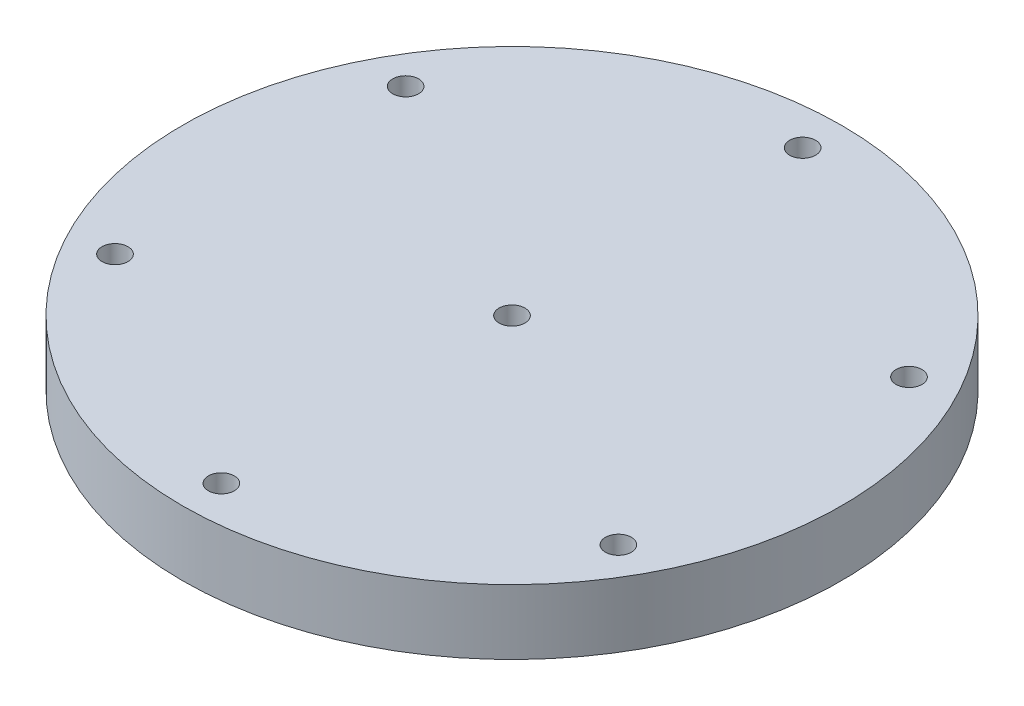
ISO-10303-21;
HEADER;
FILE_DESCRIPTION(('STEP AP214'),'2;1');
FILE_NAME('part.step','',(''),(''),'','','');
FILE_SCHEMA(('AUTOMOTIVE_DESIGN { 1 0 10303 214 1 1 1 1 }'));
ENDSEC;
DATA;
#1=APPLICATION_CONTEXT('core data for automotive mechanical design processes');
#2=APPLICATION_PROTOCOL_DEFINITION('international standard','automotive_design',2000,#1);
#3=PRODUCT_CONTEXT('',#1,'mechanical');
#4=PRODUCT('Part','Part','',(#3));
#5=PRODUCT_RELATED_PRODUCT_CATEGORY('part','',(#4));
#6=PRODUCT_DEFINITION_FORMATION('','',#4);
#7=PRODUCT_DEFINITION_CONTEXT('part definition',#1,'design');
#8=PRODUCT_DEFINITION('design','',#6,#7);
#9=PRODUCT_DEFINITION_SHAPE('','',#8);
#10=(LENGTH_UNIT() NAMED_UNIT(*) SI_UNIT(.MILLI.,.METRE.));
#11=(NAMED_UNIT(*) PLANE_ANGLE_UNIT() SI_UNIT($,.RADIAN.));
#12=(NAMED_UNIT(*) SI_UNIT($,.STERADIAN.) SOLID_ANGLE_UNIT());
#13=UNCERTAINTY_MEASURE_WITH_UNIT(LENGTH_MEASURE(1.E-05),#10,'distance_accuracy_value','');
#14=(GEOMETRIC_REPRESENTATION_CONTEXT(3) GLOBAL_UNCERTAINTY_ASSIGNED_CONTEXT((#13)) GLOBAL_UNIT_ASSIGNED_CONTEXT((#10,
#11,#12)) REPRESENTATION_CONTEXT('',''));
#15=CARTESIAN_POINT('',(0.,0.,0.));
#16=DIRECTION('',(0.,0.,1.));
#17=DIRECTION('',(1.,0.,0.));
#18=AXIS2_PLACEMENT_3D('',#15,#16,#17);
#19=CARTESIAN_POINT('',(0.,10.,0.));
#20=DIRECTION('',(0.,-1.,0.));
#21=DIRECTION('',(0.,0.,-1.));
#22=AXIS2_PLACEMENT_3D('',#19,#20,#21);
#23=CYLINDRICAL_SURFACE('',#22,50.8);
#24=CARTESIAN_POINT('',(0.,10.,0.));
#25=DIRECTION('',(0.,1.,0.));
#26=DIRECTION('',(0.,0.,1.));
#27=AXIS2_PLACEMENT_3D('',#24,#25,#26);
#28=CIRCLE('',#27,50.8);
#29=CARTESIAN_POINT('',(0.,10.,50.8));
#30=VERTEX_POINT('',#29);
#31=EDGE_CURVE('E10',#30,#30,#28,.T.);
#32=ORIENTED_EDGE('',*,*,#31,.F.);
#33=EDGE_LOOP('',(#32));
#34=FACE_BOUND('',#33,.T.);
#35=CARTESIAN_POINT('',(0.,0.,0.));
#36=DIRECTION('',(0.,1.,0.));
#37=DIRECTION('',(0.,0.,1.));
#38=AXIS2_PLACEMENT_3D('',#35,#36,#37);
#39=CIRCLE('',#38,50.8);
#40=CARTESIAN_POINT('',(0.,0.,50.8));
#41=VERTEX_POINT('',#40);
#42=EDGE_CURVE('E51',#41,#41,#39,.T.);
#43=ORIENTED_EDGE('',*,*,#42,.T.);
#44=EDGE_LOOP('',(#43));
#45=FACE_BOUND('',#44,.T.);
#46=ADVANCED_FACE('F43',(#34,#45),#23,.T.);
#47=CARTESIAN_POINT('',(0.,10.,0.));
#48=DIRECTION('',(0.,1.,0.));
#49=DIRECTION('',(0.,0.,1.));
#50=AXIS2_PLACEMENT_3D('',#47,#48,#49);
#51=PLANE('',#50);
#52=CARTESIAN_POINT('',(-38.7979380895426,10.,-22.4000000000004));
#53=DIRECTION('',(0.,1.,0.));
#54=DIRECTION('',(0.,0.,1.));
#55=AXIS2_PLACEMENT_3D('',#52,#53,#54);
#56=CIRCLE('',#55,2.);
#57=CARTESIAN_POINT('',(-38.7979380895426,10.,-20.4000000000004));
#58=VERTEX_POINT('',#57);
#59=EDGE_CURVE('E200',#58,#58,#56,.T.);
#60=ORIENTED_EDGE('',*,*,#59,.F.);
#61=EDGE_LOOP('',(#60));
#62=FACE_BOUND('',#61,.T.);
#63=CARTESIAN_POINT('',(-38.7979380895431,10.,22.3999999999996));
#64=DIRECTION('',(0.,1.,0.));
#65=DIRECTION('',(0.,0.,1.));
#66=AXIS2_PLACEMENT_3D('',#63,#64,#65);
#67=CIRCLE('',#66,2.);
#68=CARTESIAN_POINT('',(-38.7979380895431,10.,24.3999999999996));
#69=VERTEX_POINT('',#68);
#70=EDGE_CURVE('E196',#69,#69,#67,.T.);
#71=ORIENTED_EDGE('',*,*,#70,.F.);
#72=EDGE_LOOP('',(#71));
#73=FACE_BOUND('',#72,.T.);
#74=CARTESIAN_POINT('',(-3.12836727960345E-13,10.,44.8));
#75=DIRECTION('',(0.,1.,0.));
#76=DIRECTION('',(0.,0.,1.));
#77=AXIS2_PLACEMENT_3D('',#74,#75,#76);
#78=CIRCLE('',#77,2.);
#79=CARTESIAN_POINT('',(-3.12836727960345E-13,10.,46.8));
#80=VERTEX_POINT('',#79);
#81=EDGE_CURVE('E192',#80,#80,#78,.T.);
#82=ORIENTED_EDGE('',*,*,#81,.F.);
#83=EDGE_LOOP('',(#82));
#84=FACE_BOUND('',#83,.T.);
#85=CARTESIAN_POINT('',(38.7979380895428,10.,22.4000000000002));
#86=DIRECTION('',(0.,1.,0.));
#87=DIRECTION('',(0.,0.,1.));
#88=AXIS2_PLACEMENT_3D('',#85,#86,#87);
#89=CIRCLE('',#88,2.);
#90=CARTESIAN_POINT('',(38.7979380895428,10.,24.4000000000002));
#91=VERTEX_POINT('',#90);
#92=EDGE_CURVE('E186',#91,#91,#89,.T.);
#93=ORIENTED_EDGE('',*,*,#92,.F.);
#94=EDGE_LOOP('',(#93));
#95=FACE_BOUND('',#94,.T.);
#96=CARTESIAN_POINT('',(38.7979380895429,10.,-22.3999999999999));
#97=DIRECTION('',(0.,1.,0.));
#98=DIRECTION('',(0.,0.,1.));
#99=AXIS2_PLACEMENT_3D('',#96,#97,#98);
#100=CIRCLE('',#99,2.);
#101=CARTESIAN_POINT('',(38.7979380895429,10.,-20.3999999999999));
#102=VERTEX_POINT('',#101);
#103=EDGE_CURVE('E180',#102,#102,#100,.T.);
#104=ORIENTED_EDGE('',*,*,#103,.F.);
#105=EDGE_LOOP('',(#104));
#106=FACE_BOUND('',#105,.T.);
#107=CARTESIAN_POINT('',(0.,10.,-44.8));
#108=DIRECTION('',(0.,1.,0.));
#109=DIRECTION('',(0.,0.,1.));
#110=AXIS2_PLACEMENT_3D('',#107,#108,#109);
#111=CIRCLE('',#110,2.);
#112=CARTESIAN_POINT('',(0.,10.,-42.8));
#113=VERTEX_POINT('',#112);
#114=EDGE_CURVE('E175',#113,#113,#111,.T.);
#115=ORIENTED_EDGE('',*,*,#114,.F.);
#116=EDGE_LOOP('',(#115));
#117=FACE_BOUND('',#116,.T.);
#118=CARTESIAN_POINT('',(0.,10.,0.));
#119=DIRECTION('',(0.,1.,0.));
#120=DIRECTION('',(0.,0.,1.));
#121=AXIS2_PLACEMENT_3D('',#118,#119,#120);
#122=CIRCLE('',#121,2.);
#123=CARTESIAN_POINT('',(0.,10.,2.));
#124=VERTEX_POINT('',#123);
#125=EDGE_CURVE('E68',#124,#124,#122,.T.);
#126=ORIENTED_EDGE('',*,*,#125,.F.);
#127=EDGE_LOOP('',(#126));
#128=FACE_BOUND('',#127,.T.);
#129=ORIENTED_EDGE('',*,*,#31,.T.);
#130=EDGE_LOOP('',(#129));
#131=FACE_BOUND('',#130,.T.);
#132=ADVANCED_FACE('F116',(#62,#73,#84,#95,#106,#117,#128,#131),#51,.T.);
#133=CARTESIAN_POINT('',(0.,0.,0.));
#134=DIRECTION('',(0.,1.,0.));
#135=DIRECTION('',(0.,0.,1.));
#136=AXIS2_PLACEMENT_3D('',#133,#134,#135);
#137=PLANE('',#136);
#138=CARTESIAN_POINT('',(-38.7979380895426,0.,-22.4000000000004));
#139=DIRECTION('',(0.,1.,0.));
#140=DIRECTION('',(0.,0.,1.));
#141=AXIS2_PLACEMENT_3D('',#138,#139,#140);
#142=CIRCLE('',#141,2.);
#143=CARTESIAN_POINT('',(-38.7979380895426,0.,-20.4000000000004));
#144=VERTEX_POINT('',#143);
#145=EDGE_CURVE('E46',#144,#144,#142,.T.);
#146=ORIENTED_EDGE('',*,*,#145,.T.);
#147=EDGE_LOOP('',(#146));
#148=FACE_BOUND('',#147,.T.);
#149=CARTESIAN_POINT('',(-38.7979380895431,0.,22.3999999999996));
#150=DIRECTION('',(0.,1.,0.));
#151=DIRECTION('',(0.,0.,1.));
#152=AXIS2_PLACEMENT_3D('',#149,#150,#151);
#153=CIRCLE('',#152,2.);
#154=CARTESIAN_POINT('',(-38.7979380895431,0.,24.3999999999996));
#155=VERTEX_POINT('',#154);
#156=EDGE_CURVE('E83',#155,#155,#153,.T.);
#157=ORIENTED_EDGE('',*,*,#156,.T.);
#158=EDGE_LOOP('',(#157));
#159=FACE_BOUND('',#158,.T.);
#160=CARTESIAN_POINT('',(-3.12836727960345E-13,0.,44.8));
#161=DIRECTION('',(0.,1.,0.));
#162=DIRECTION('',(0.,0.,1.));
#163=AXIS2_PLACEMENT_3D('',#160,#161,#162);
#164=CIRCLE('',#163,2.);
#165=CARTESIAN_POINT('',(-3.12836727960345E-13,0.,46.8));
#166=VERTEX_POINT('',#165);
#167=EDGE_CURVE('E80',#166,#166,#164,.T.);
#168=ORIENTED_EDGE('',*,*,#167,.T.);
#169=EDGE_LOOP('',(#168));
#170=FACE_BOUND('',#169,.T.);
#171=CARTESIAN_POINT('',(38.7979380895428,0.,22.4000000000002));
#172=DIRECTION('',(0.,1.,0.));
#173=DIRECTION('',(0.,0.,1.));
#174=AXIS2_PLACEMENT_3D('',#171,#172,#173);
#175=CIRCLE('',#174,2.);
#176=CARTESIAN_POINT('',(38.7979380895428,0.,24.4000000000002));
#177=VERTEX_POINT('',#176);
#178=EDGE_CURVE('E76',#177,#177,#175,.T.);
#179=ORIENTED_EDGE('',*,*,#178,.T.);
#180=EDGE_LOOP('',(#179));
#181=FACE_BOUND('',#180,.T.);
#182=CARTESIAN_POINT('',(38.7979380895429,0.,-22.3999999999999));
#183=DIRECTION('',(0.,1.,0.));
#184=DIRECTION('',(0.,0.,1.));
#185=AXIS2_PLACEMENT_3D('',#182,#183,#184);
#186=CIRCLE('',#185,2.);
#187=CARTESIAN_POINT('',(38.7979380895429,0.,-20.3999999999999));
#188=VERTEX_POINT('',#187);
#189=EDGE_CURVE('E72',#188,#188,#186,.T.);
#190=ORIENTED_EDGE('',*,*,#189,.T.);
#191=EDGE_LOOP('',(#190));
#192=FACE_BOUND('',#191,.T.);
#193=CARTESIAN_POINT('',(0.,0.,-44.8));
#194=DIRECTION('',(0.,1.,0.));
#195=DIRECTION('',(0.,0.,1.));
#196=AXIS2_PLACEMENT_3D('',#193,#194,#195);
#197=CIRCLE('',#196,2.);
#198=CARTESIAN_POINT('',(0.,0.,-42.8));
#199=VERTEX_POINT('',#198);
#200=EDGE_CURVE('E67',#199,#199,#197,.T.);
#201=ORIENTED_EDGE('',*,*,#200,.T.);
#202=EDGE_LOOP('',(#201));
#203=FACE_BOUND('',#202,.T.);
#204=CARTESIAN_POINT('',(0.,0.,0.));
#205=DIRECTION('',(0.,-1.,0.));
#206=DIRECTION('',(0.,0.,-1.));
#207=AXIS2_PLACEMENT_3D('',#204,#205,#206);
#208=CIRCLE('',#207,38.1);
#209=CARTESIAN_POINT('',(0.,0.,-38.1));
#210=VERTEX_POINT('',#209);
#211=EDGE_CURVE('E60',#210,#210,#208,.T.);
#212=ORIENTED_EDGE('',*,*,#211,.F.);
#213=EDGE_LOOP('',(#212));
#214=FACE_BOUND('',#213,.T.);
#215=ORIENTED_EDGE('',*,*,#42,.F.);
#216=EDGE_LOOP('',(#215));
#217=FACE_BOUND('',#216,.T.);
#218=ADVANCED_FACE('F113',(#148,#159,#170,#181,#192,#203,#214,#217),#137,.F.);
#219=CARTESIAN_POINT('',(0.,2.,0.));
#220=DIRECTION('',(0.,-1.,0.));
#221=DIRECTION('',(0.,0.,-1.));
#222=AXIS2_PLACEMENT_3D('',#219,#220,#221);
#223=CYLINDRICAL_SURFACE('',#222,38.1);
#224=CARTESIAN_POINT('',(0.,2.,0.));
#225=DIRECTION('',(0.,-1.,0.));
#226=DIRECTION('',(0.,0.,-1.));
#227=AXIS2_PLACEMENT_3D('',#224,#225,#226);
#228=CIRCLE('',#227,38.1);
#229=CARTESIAN_POINT('',(0.,2.,-38.1));
#230=VERTEX_POINT('',#229);
#231=EDGE_CURVE('E57',#230,#230,#228,.T.);
#232=ORIENTED_EDGE('',*,*,#231,.F.);
#233=EDGE_LOOP('',(#232));
#234=FACE_BOUND('',#233,.T.);
#235=ORIENTED_EDGE('',*,*,#211,.T.);
#236=EDGE_LOOP('',(#235));
#237=FACE_BOUND('',#236,.T.);
#238=ADVANCED_FACE('F111',(#234,#237),#223,.F.);
#239=CARTESIAN_POINT('',(0.,2.,0.));
#240=DIRECTION('',(0.,-1.,0.));
#241=DIRECTION('',(0.,0.,-1.));
#242=AXIS2_PLACEMENT_3D('',#239,#240,#241);
#243=PLANE('',#242);
#244=CARTESIAN_POINT('',(0.,2.,0.));
#245=DIRECTION('',(0.,-1.,0.));
#246=DIRECTION('',(0.,0.,-1.));
#247=AXIS2_PLACEMENT_3D('',#244,#245,#246);
#248=CIRCLE('',#247,36.5);
#249=CARTESIAN_POINT('',(0.,2.,-36.5));
#250=VERTEX_POINT('',#249);
#251=EDGE_CURVE('E95',#250,#250,#248,.T.);
#252=ORIENTED_EDGE('',*,*,#251,.F.);
#253=EDGE_LOOP('',(#252));
#254=FACE_BOUND('',#253,.T.);
#255=ORIENTED_EDGE('',*,*,#231,.T.);
#256=EDGE_LOOP('',(#255));
#257=FACE_BOUND('',#256,.T.);
#258=ADVANCED_FACE('F135',(#254,#257),#243,.T.);
#259=CARTESIAN_POINT('',(0.,2.,0.));
#260=DIRECTION('',(0.,-1.,0.));
#261=DIRECTION('',(0.,0.,-1.));
#262=AXIS2_PLACEMENT_3D('',#259,#260,#261);
#263=CYLINDRICAL_SURFACE('',#262,36.5);
#264=ORIENTED_EDGE('',*,*,#251,.T.);
#265=EDGE_LOOP('',(#264));
#266=FACE_BOUND('',#265,.T.);
#267=CARTESIAN_POINT('',(0.,0.,0.));
#268=DIRECTION('',(0.,-1.,0.));
#269=DIRECTION('',(0.,0.,-1.));
#270=AXIS2_PLACEMENT_3D('',#267,#268,#269);
#271=CIRCLE('',#270,36.5);
#272=CARTESIAN_POINT('',(0.,0.,-36.5));
#273=VERTEX_POINT('',#272);
#274=EDGE_CURVE('E90',#273,#273,#271,.T.);
#275=ORIENTED_EDGE('',*,*,#274,.F.);
#276=EDGE_LOOP('',(#275));
#277=FACE_BOUND('',#276,.T.);
#278=ADVANCED_FACE('F139',(#266,#277),#263,.T.);
#279=CARTESIAN_POINT('',(0.,0.,0.));
#280=DIRECTION('',(0.,1.,0.));
#281=DIRECTION('',(0.,0.,1.));
#282=AXIS2_PLACEMENT_3D('',#279,#280,#281);
#283=CIRCLE('',#282,2.);
#284=CARTESIAN_POINT('',(0.,0.,2.));
#285=VERTEX_POINT('',#284);
#286=EDGE_CURVE('E63',#285,#285,#283,.T.);
#287=ORIENTED_EDGE('',*,*,#286,.T.);
#288=EDGE_LOOP('',(#287));
#289=FACE_BOUND('',#288,.T.);
#290=ORIENTED_EDGE('',*,*,#274,.T.);
#291=EDGE_LOOP('',(#290));
#292=FACE_BOUND('',#291,.T.);
#293=ADVANCED_FACE('F117',(#289,#292),#137,.F.);
#294=CARTESIAN_POINT('',(0.,-4.,0.));
#295=DIRECTION('',(0.,1.,0.));
#296=DIRECTION('',(0.,0.,1.));
#297=AXIS2_PLACEMENT_3D('',#294,#295,#296);
#298=CYLINDRICAL_SURFACE('',#297,2.);
#299=ORIENTED_EDGE('',*,*,#125,.T.);
#300=EDGE_LOOP('',(#299));
#301=FACE_BOUND('',#300,.T.);
#302=ORIENTED_EDGE('',*,*,#286,.F.);
#303=EDGE_LOOP('',(#302));
#304=FACE_BOUND('',#303,.T.);
#305=ADVANCED_FACE('F143',(#301,#304),#298,.F.);
#306=CARTESIAN_POINT('',(0.,-4.,-44.8));
#307=DIRECTION('',(0.,1.,0.));
#308=DIRECTION('',(0.,0.,1.));
#309=AXIS2_PLACEMENT_3D('',#306,#307,#308);
#310=CYLINDRICAL_SURFACE('',#309,2.);
#311=ORIENTED_EDGE('',*,*,#114,.T.);
#312=EDGE_LOOP('',(#311));
#313=FACE_BOUND('',#312,.T.);
#314=ORIENTED_EDGE('',*,*,#200,.F.);
#315=EDGE_LOOP('',(#314));
#316=FACE_BOUND('',#315,.T.);
#317=ADVANCED_FACE('F146',(#313,#316),#310,.F.);
#318=CARTESIAN_POINT('',(38.7979380895429,-4.,-22.3999999999999));
#319=DIRECTION('',(0.,1.,0.));
#320=DIRECTION('',(0.,0.,1.));
#321=AXIS2_PLACEMENT_3D('',#318,#319,#320);
#322=CYLINDRICAL_SURFACE('',#321,2.);
#323=ORIENTED_EDGE('',*,*,#103,.T.);
#324=EDGE_LOOP('',(#323));
#325=FACE_BOUND('',#324,.T.);
#326=ORIENTED_EDGE('',*,*,#189,.F.);
#327=EDGE_LOOP('',(#326));
#328=FACE_BOUND('',#327,.T.);
#329=ADVANCED_FACE('F163',(#325,#328),#322,.F.);
#330=CARTESIAN_POINT('',(38.7979380895428,-4.,22.4000000000002));
#331=DIRECTION('',(0.,1.,0.));
#332=DIRECTION('',(0.,0.,1.));
#333=AXIS2_PLACEMENT_3D('',#330,#331,#332);
#334=CYLINDRICAL_SURFACE('',#333,2.);
#335=ORIENTED_EDGE('',*,*,#92,.T.);
#336=EDGE_LOOP('',(#335));
#337=FACE_BOUND('',#336,.T.);
#338=ORIENTED_EDGE('',*,*,#178,.F.);
#339=EDGE_LOOP('',(#338));
#340=FACE_BOUND('',#339,.T.);
#341=ADVANCED_FACE('F159',(#337,#340),#334,.F.);
#342=CARTESIAN_POINT('',(-3.12836727960345E-13,-4.,44.8));
#343=DIRECTION('',(0.,1.,0.));
#344=DIRECTION('',(0.,0.,1.));
#345=AXIS2_PLACEMENT_3D('',#342,#343,#344);
#346=CYLINDRICAL_SURFACE('',#345,2.);
#347=ORIENTED_EDGE('',*,*,#81,.T.);
#348=EDGE_LOOP('',(#347));
#349=FACE_BOUND('',#348,.T.);
#350=ORIENTED_EDGE('',*,*,#167,.F.);
#351=EDGE_LOOP('',(#350));
#352=FACE_BOUND('',#351,.T.);
#353=ADVANCED_FACE('F155',(#349,#352),#346,.F.);
#354=CARTESIAN_POINT('',(-38.7979380895431,-4.,22.3999999999996));
#355=DIRECTION('',(0.,1.,0.));
#356=DIRECTION('',(0.,0.,1.));
#357=AXIS2_PLACEMENT_3D('',#354,#355,#356);
#358=CYLINDRICAL_SURFACE('',#357,2.);
#359=ORIENTED_EDGE('',*,*,#70,.T.);
#360=EDGE_LOOP('',(#359));
#361=FACE_BOUND('',#360,.T.);
#362=ORIENTED_EDGE('',*,*,#156,.F.);
#363=EDGE_LOOP('',(#362));
#364=FACE_BOUND('',#363,.T.);
#365=ADVANCED_FACE('F151',(#361,#364),#358,.F.);
#366=CARTESIAN_POINT('',(-38.7979380895426,-4.,-22.4000000000004));
#367=DIRECTION('',(0.,1.,0.));
#368=DIRECTION('',(0.,0.,1.));
#369=AXIS2_PLACEMENT_3D('',#366,#367,#368);
#370=CYLINDRICAL_SURFACE('',#369,2.);
#371=ORIENTED_EDGE('',*,*,#59,.T.);
#372=EDGE_LOOP('',(#371));
#373=FACE_BOUND('',#372,.T.);
#374=ORIENTED_EDGE('',*,*,#145,.F.);
#375=EDGE_LOOP('',(#374));
#376=FACE_BOUND('',#375,.T.);
#377=ADVANCED_FACE('F148',(#373,#376),#370,.F.);
#378=CLOSED_SHELL('',(#46,#132,#218,#238,#258,#278,#293,#305,#317,#329,#341,#353,#365,#377));
#379=MANIFOLD_SOLID_BREP('B2',#378);
#380=ADVANCED_BREP_SHAPE_REPRESENTATION('',(#18,#379),#14);
#381=SHAPE_DEFINITION_REPRESENTATION(#9,#380);
ENDSEC;
END-ISO-10303-21;
